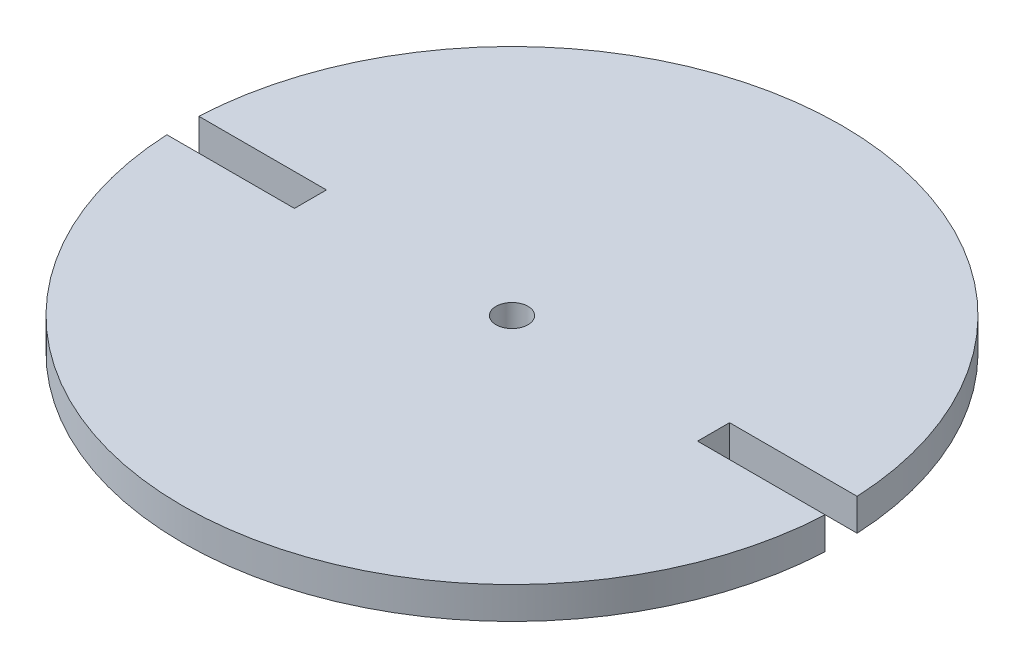
ISO-10303-21;
HEADER;
FILE_DESCRIPTION(('STEP AP214'),'2;1');
FILE_NAME('part.step','',(''),(''),'','','');
FILE_SCHEMA(('AUTOMOTIVE_DESIGN { 1 0 10303 214 1 1 1 1 }'));
ENDSEC;
DATA;
#1=APPLICATION_CONTEXT('core data for automotive mechanical design processes');
#2=APPLICATION_PROTOCOL_DEFINITION('international standard','automotive_design',2000,#1);
#3=PRODUCT_CONTEXT('',#1,'mechanical');
#4=PRODUCT('Part','Part','',(#3));
#5=PRODUCT_RELATED_PRODUCT_CATEGORY('part','',(#4));
#6=PRODUCT_DEFINITION_FORMATION('','',#4);
#7=PRODUCT_DEFINITION_CONTEXT('part definition',#1,'design');
#8=PRODUCT_DEFINITION('design','',#6,#7);
#9=PRODUCT_DEFINITION_SHAPE('','',#8);
#10=(LENGTH_UNIT() NAMED_UNIT(*) SI_UNIT(.MILLI.,.METRE.));
#11=(NAMED_UNIT(*) PLANE_ANGLE_UNIT() SI_UNIT($,.RADIAN.));
#12=(NAMED_UNIT(*) SI_UNIT($,.STERADIAN.) SOLID_ANGLE_UNIT());
#13=UNCERTAINTY_MEASURE_WITH_UNIT(LENGTH_MEASURE(1.E-05),#10,'distance_accuracy_value','');
#14=(GEOMETRIC_REPRESENTATION_CONTEXT(3) GLOBAL_UNCERTAINTY_ASSIGNED_CONTEXT((#13)) GLOBAL_UNIT_ASSIGNED_CONTEXT((#10,
#11,#12)) REPRESENTATION_CONTEXT('',''));
#15=CARTESIAN_POINT('',(0.,0.,0.));
#16=DIRECTION('',(0.,0.,1.));
#17=DIRECTION('',(1.,0.,0.));
#18=AXIS2_PLACEMENT_3D('',#15,#16,#17);
#19=CARTESIAN_POINT('',(0.,6.35,0.));
#20=DIRECTION('',(0.,-1.,0.));
#21=DIRECTION('',(0.,0.,-1.));
#22=AXIS2_PLACEMENT_3D('',#19,#20,#21);
#23=CYLINDRICAL_SURFACE('',#22,65.405);
#24=CARTESIAN_POINT('',(0.,6.35,0.));
#25=DIRECTION('',(0.,1.,0.));
#26=DIRECTION('',(0.,0.,1.));
#27=AXIS2_PLACEMENT_3D('',#24,#25,#26);
#28=CIRCLE('',#27,65.405);
#29=CARTESIAN_POINT('',(-65.3278914400274,6.35,3.175));
#30=VERTEX_POINT('',#29);
#31=CARTESIAN_POINT('',(65.3278914400274,6.35,3.175));
#32=VERTEX_POINT('',#31);
#33=EDGE_CURVE('E164',#30,#32,#28,.T.);
#34=ORIENTED_EDGE('',*,*,#33,.F.);
#35=DIRECTION('',(0.,-1.,0.));
#36=VECTOR('',#35,1.);
#37=CARTESIAN_POINT('',(-65.3278914400274,6.35,3.175));
#38=LINE('',#37,#36);
#39=CARTESIAN_POINT('',(-65.3278914400274,0.,3.175));
#40=VERTEX_POINT('',#39);
#41=EDGE_CURVE('E160',#30,#40,#38,.T.);
#42=ORIENTED_EDGE('',*,*,#41,.T.);
#43=CARTESIAN_POINT('',(0.,0.,0.));
#44=DIRECTION('',(0.,1.,0.));
#45=DIRECTION('',(0.,0.,1.));
#46=AXIS2_PLACEMENT_3D('',#43,#44,#45);
#47=CIRCLE('',#46,65.405);
#48=CARTESIAN_POINT('',(65.3278914400274,0.,3.175));
#49=VERTEX_POINT('',#48);
#50=EDGE_CURVE('E163',#40,#49,#47,.T.);
#51=ORIENTED_EDGE('',*,*,#50,.T.);
#52=DIRECTION('',(0.,-1.,0.));
#53=VECTOR('',#52,1.);
#54=CARTESIAN_POINT('',(65.3278914400274,6.35,3.175));
#55=LINE('',#54,#53);
#56=EDGE_CURVE('E64',#49,#32,#55,.F.);
#57=ORIENTED_EDGE('',*,*,#56,.T.);
#58=EDGE_LOOP('',(#34,#42,#51,#57));
#59=FACE_BOUND('',#58,.T.);
#60=ADVANCED_FACE('F41',(#59),#23,.T.);
#61=CARTESIAN_POINT('',(65.3278914400274,0.,-3.175));
#62=VERTEX_POINT('',#61);
#63=CARTESIAN_POINT('',(-65.3278914400274,0.,-3.175));
#64=VERTEX_POINT('',#63);
#65=EDGE_CURVE('E168',#62,#64,#47,.T.);
#66=ORIENTED_EDGE('',*,*,#65,.T.);
#67=DIRECTION('',(0.,-1.,0.));
#68=VECTOR('',#67,1.);
#69=CARTESIAN_POINT('',(-65.3278914400274,6.35,-3.175));
#70=LINE('',#69,#68);
#71=CARTESIAN_POINT('',(-65.3278914400274,6.35,-3.175));
#72=VERTEX_POINT('',#71);
#73=EDGE_CURVE('E56',#64,#72,#70,.F.);
#74=ORIENTED_EDGE('',*,*,#73,.T.);
#75=CARTESIAN_POINT('',(65.3278914400274,6.35,-3.175));
#76=VERTEX_POINT('',#75);
#77=EDGE_CURVE('E167',#76,#72,#28,.T.);
#78=ORIENTED_EDGE('',*,*,#77,.F.);
#79=DIRECTION('',(0.,-1.,0.));
#80=VECTOR('',#79,1.);
#81=CARTESIAN_POINT('',(65.3278914400274,6.35,-3.175));
#82=LINE('',#81,#80);
#83=EDGE_CURVE('E156',#76,#62,#82,.T.);
#84=ORIENTED_EDGE('',*,*,#83,.T.);
#85=EDGE_LOOP('',(#66,#74,#78,#84));
#86=FACE_BOUND('',#85,.T.);
#87=ADVANCED_FACE('F43',(#86),#23,.T.);
#88=CARTESIAN_POINT('',(0.,6.35,0.));
#89=DIRECTION('',(0.,1.,0.));
#90=DIRECTION('',(0.,0.,1.));
#91=AXIS2_PLACEMENT_3D('',#88,#89,#90);
#92=PLANE('',#91);
#93=CARTESIAN_POINT('',(0.,6.35,0.));
#94=DIRECTION('',(0.,1.,0.));
#95=DIRECTION('',(0.,0.,1.));
#96=AXIS2_PLACEMENT_3D('',#93,#94,#95);
#97=CIRCLE('',#96,3.175);
#98=CARTESIAN_POINT('',(0.,6.35,3.175));
#99=VERTEX_POINT('',#98);
#100=EDGE_CURVE('E131',#99,#99,#97,.T.);
#101=ORIENTED_EDGE('',*,*,#100,.F.);
#102=EDGE_LOOP('',(#101));
#103=FACE_BOUND('',#102,.T.);
#104=DIRECTION('',(1.,0.,0.));
#105=VECTOR('',#104,1.);
#106=CARTESIAN_POINT('',(-90.805,6.35,3.175));
#107=LINE('',#106,#105);
#108=CARTESIAN_POINT('',(-40.005,6.35,3.175));
#109=VERTEX_POINT('',#108);
#110=EDGE_CURVE('E126',#30,#109,#107,.T.);
#111=ORIENTED_EDGE('',*,*,#110,.F.);
#112=ORIENTED_EDGE('',*,*,#33,.T.);
#113=DIRECTION('',(1.,0.,0.));
#114=VECTOR('',#113,1.);
#115=CARTESIAN_POINT('',(90.805,6.35,3.175));
#116=LINE('',#115,#114);
#117=CARTESIAN_POINT('',(40.005,6.35,3.175));
#118=VERTEX_POINT('',#117);
#119=EDGE_CURVE('E147',#118,#32,#116,.T.);
#120=ORIENTED_EDGE('',*,*,#119,.F.);
#121=DIRECTION('',(0.,0.,1.));
#122=VECTOR('',#121,1.);
#123=CARTESIAN_POINT('',(40.005,6.35,-3.175));
#124=LINE('',#123,#122);
#125=CARTESIAN_POINT('',(40.005,6.35,-3.175));
#126=VERTEX_POINT('',#125);
#127=EDGE_CURVE('E135',#126,#118,#124,.T.);
#128=ORIENTED_EDGE('',*,*,#127,.F.);
#129=DIRECTION('',(-1.,0.,0.));
#130=VECTOR('',#129,1.);
#131=CARTESIAN_POINT('',(90.805,6.35,-3.175));
#132=LINE('',#131,#130);
#133=EDGE_CURVE('E145',#76,#126,#132,.T.);
#134=ORIENTED_EDGE('',*,*,#133,.F.);
#135=ORIENTED_EDGE('',*,*,#77,.T.);
#136=DIRECTION('',(-1.,0.,0.));
#137=VECTOR('',#136,1.);
#138=CARTESIAN_POINT('',(-90.805,6.35,-3.175));
#139=LINE('',#138,#137);
#140=CARTESIAN_POINT('',(-40.005,6.35,-3.175));
#141=VERTEX_POINT('',#140);
#142=EDGE_CURVE('E128',#141,#72,#139,.T.);
#143=ORIENTED_EDGE('',*,*,#142,.F.);
#144=DIRECTION('',(0.,0.,-1.));
#145=VECTOR('',#144,1.);
#146=CARTESIAN_POINT('',(-40.005,6.35,3.175));
#147=LINE('',#146,#145);
#148=EDGE_CURVE('E114',#109,#141,#147,.T.);
#149=ORIENTED_EDGE('',*,*,#148,.F.);
#150=EDGE_LOOP('',(#111,#112,#120,#128,#134,#135,#143,#149));
#151=FACE_BOUND('',#150,.T.);
#152=ADVANCED_FACE('F176',(#103,#151),#92,.T.);
#153=CARTESIAN_POINT('',(0.,0.,0.));
#154=DIRECTION('',(0.,1.,0.));
#155=DIRECTION('',(0.,0.,1.));
#156=AXIS2_PLACEMENT_3D('',#153,#154,#155);
#157=PLANE('',#156);
#158=CARTESIAN_POINT('',(0.,0.,0.));
#159=DIRECTION('',(0.,1.,0.));
#160=DIRECTION('',(0.,0.,1.));
#161=AXIS2_PLACEMENT_3D('',#158,#159,#160);
#162=CIRCLE('',#161,3.175);
#163=CARTESIAN_POINT('',(0.,0.,3.175));
#164=VERTEX_POINT('',#163);
#165=EDGE_CURVE('E144',#164,#164,#162,.T.);
#166=ORIENTED_EDGE('',*,*,#165,.T.);
#167=EDGE_LOOP('',(#166));
#168=FACE_BOUND('',#167,.T.);
#169=ORIENTED_EDGE('',*,*,#50,.F.);
#170=DIRECTION('',(1.,0.,0.));
#171=VECTOR('',#170,1.);
#172=CARTESIAN_POINT('',(0.,0.,3.175));
#173=LINE('',#172,#171);
#174=CARTESIAN_POINT('',(-40.005,0.,3.175));
#175=VERTEX_POINT('',#174);
#176=EDGE_CURVE('E11',#40,#175,#173,.T.);
#177=ORIENTED_EDGE('',*,*,#176,.T.);
#178=DIRECTION('',(0.,0.,-1.));
#179=VECTOR('',#178,1.);
#180=CARTESIAN_POINT('',(-40.005,0.,3.175));
#181=LINE('',#180,#179);
#182=CARTESIAN_POINT('',(-40.005,0.,-3.175));
#183=VERTEX_POINT('',#182);
#184=EDGE_CURVE('E112',#175,#183,#181,.T.);
#185=ORIENTED_EDGE('',*,*,#184,.T.);
#186=DIRECTION('',(-1.,0.,0.));
#187=VECTOR('',#186,1.);
#188=CARTESIAN_POINT('',(-90.805,0.,-3.175));
#189=LINE('',#188,#187);
#190=EDGE_CURVE('E117',#183,#64,#189,.T.);
#191=ORIENTED_EDGE('',*,*,#190,.T.);
#192=ORIENTED_EDGE('',*,*,#65,.F.);
#193=DIRECTION('',(-1.,0.,0.));
#194=VECTOR('',#193,1.);
#195=CARTESIAN_POINT('',(0.,0.,-3.17499999999999));
#196=LINE('',#195,#194);
#197=CARTESIAN_POINT('',(40.005,0.,-3.175));
#198=VERTEX_POINT('',#197);
#199=EDGE_CURVE('E49',#62,#198,#196,.T.);
#200=ORIENTED_EDGE('',*,*,#199,.T.);
#201=DIRECTION('',(0.,0.,1.));
#202=VECTOR('',#201,1.);
#203=CARTESIAN_POINT('',(40.005,0.,-3.175));
#204=LINE('',#203,#202);
#205=CARTESIAN_POINT('',(40.005,0.,3.175));
#206=VERTEX_POINT('',#205);
#207=EDGE_CURVE('E148',#198,#206,#204,.T.);
#208=ORIENTED_EDGE('',*,*,#207,.T.);
#209=DIRECTION('',(1.,0.,0.));
#210=VECTOR('',#209,1.);
#211=CARTESIAN_POINT('',(90.805,0.,3.175));
#212=LINE('',#211,#210);
#213=EDGE_CURVE('E140',#206,#49,#212,.T.);
#214=ORIENTED_EDGE('',*,*,#213,.T.);
#215=EDGE_LOOP('',(#169,#177,#185,#191,#192,#200,#208,#214));
#216=FACE_BOUND('',#215,.T.);
#217=ADVANCED_FACE('F125',(#168,#216),#157,.F.);
#218=CARTESIAN_POINT('',(90.805,0.,-3.175));
#219=DIRECTION('',(0.,0.,-1.));
#220=DIRECTION('',(-1.,0.,0.));
#221=AXIS2_PLACEMENT_3D('',#218,#219,#220);
#222=PLANE('',#221);
#223=ORIENTED_EDGE('',*,*,#133,.T.);
#224=DIRECTION('',(0.,1.,0.));
#225=VECTOR('',#224,1.);
#226=CARTESIAN_POINT('',(40.005,0.,-3.175));
#227=LINE('',#226,#225);
#228=EDGE_CURVE('E141',#198,#126,#227,.T.);
#229=ORIENTED_EDGE('',*,*,#228,.F.);
#230=ORIENTED_EDGE('',*,*,#199,.F.);
#231=ORIENTED_EDGE('',*,*,#83,.F.);
#232=EDGE_LOOP('',(#223,#229,#230,#231));
#233=FACE_BOUND('',#232,.T.);
#234=ADVANCED_FACE('F180',(#233),#222,.F.);
#235=CARTESIAN_POINT('',(90.805,0.,3.175));
#236=DIRECTION('',(0.,0.,1.));
#237=DIRECTION('',(1.,0.,0.));
#238=AXIS2_PLACEMENT_3D('',#235,#236,#237);
#239=PLANE('',#238);
#240=ORIENTED_EDGE('',*,*,#213,.F.);
#241=DIRECTION('',(0.,1.,0.));
#242=VECTOR('',#241,1.);
#243=CARTESIAN_POINT('',(40.005,0.,3.175));
#244=LINE('',#243,#242);
#245=EDGE_CURVE('E138',#206,#118,#244,.T.);
#246=ORIENTED_EDGE('',*,*,#245,.T.);
#247=ORIENTED_EDGE('',*,*,#119,.T.);
#248=ORIENTED_EDGE('',*,*,#56,.F.);
#249=EDGE_LOOP('',(#240,#246,#247,#248));
#250=FACE_BOUND('',#249,.T.);
#251=ADVANCED_FACE('F189',(#250),#239,.F.);
#252=CARTESIAN_POINT('',(40.005,0.,-3.175));
#253=DIRECTION('',(-1.,0.,0.));
#254=DIRECTION('',(0.,0.,1.));
#255=AXIS2_PLACEMENT_3D('',#252,#253,#254);
#256=PLANE('',#255);
#257=ORIENTED_EDGE('',*,*,#127,.T.);
#258=ORIENTED_EDGE('',*,*,#245,.F.);
#259=ORIENTED_EDGE('',*,*,#207,.F.);
#260=ORIENTED_EDGE('',*,*,#228,.T.);
#261=EDGE_LOOP('',(#257,#258,#259,#260));
#262=FACE_BOUND('',#261,.T.);
#263=ADVANCED_FACE('F183',(#262),#256,.F.);
#264=CARTESIAN_POINT('',(-90.805,0.,3.175));
#265=DIRECTION('',(0.,0.,1.));
#266=DIRECTION('',(1.,0.,0.));
#267=AXIS2_PLACEMENT_3D('',#264,#265,#266);
#268=PLANE('',#267);
#269=ORIENTED_EDGE('',*,*,#110,.T.);
#270=DIRECTION('',(0.,1.,0.));
#271=VECTOR('',#270,1.);
#272=CARTESIAN_POINT('',(-40.005,0.,3.175));
#273=LINE('',#272,#271);
#274=EDGE_CURVE('E116',#175,#109,#273,.T.);
#275=ORIENTED_EDGE('',*,*,#274,.F.);
#276=ORIENTED_EDGE('',*,*,#176,.F.);
#277=ORIENTED_EDGE('',*,*,#41,.F.);
#278=EDGE_LOOP('',(#269,#275,#276,#277));
#279=FACE_BOUND('',#278,.T.);
#280=ADVANCED_FACE('F187',(#279),#268,.F.);
#281=CARTESIAN_POINT('',(-90.805,0.,-3.175));
#282=DIRECTION('',(0.,0.,-1.));
#283=DIRECTION('',(-1.,0.,0.));
#284=AXIS2_PLACEMENT_3D('',#281,#282,#283);
#285=PLANE('',#284);
#286=ORIENTED_EDGE('',*,*,#190,.F.);
#287=DIRECTION('',(0.,1.,0.));
#288=VECTOR('',#287,1.);
#289=CARTESIAN_POINT('',(-40.005,0.,-3.175));
#290=LINE('',#289,#288);
#291=EDGE_CURVE('E108',#183,#141,#290,.T.);
#292=ORIENTED_EDGE('',*,*,#291,.T.);
#293=ORIENTED_EDGE('',*,*,#142,.T.);
#294=ORIENTED_EDGE('',*,*,#73,.F.);
#295=EDGE_LOOP('',(#286,#292,#293,#294));
#296=FACE_BOUND('',#295,.T.);
#297=ADVANCED_FACE('F119',(#296),#285,.F.);
#298=CARTESIAN_POINT('',(-40.005,0.,3.175));
#299=DIRECTION('',(1.,0.,0.));
#300=DIRECTION('',(0.,0.,-1.));
#301=AXIS2_PLACEMENT_3D('',#298,#299,#300);
#302=PLANE('',#301);
#303=ORIENTED_EDGE('',*,*,#148,.T.);
#304=ORIENTED_EDGE('',*,*,#291,.F.);
#305=ORIENTED_EDGE('',*,*,#184,.F.);
#306=ORIENTED_EDGE('',*,*,#274,.T.);
#307=EDGE_LOOP('',(#303,#304,#305,#306));
#308=FACE_BOUND('',#307,.T.);
#309=ADVANCED_FACE('F109',(#308),#302,.F.);
#310=CARTESIAN_POINT('',(0.,0.,0.));
#311=DIRECTION('',(0.,1.,0.));
#312=DIRECTION('',(0.,0.,1.));
#313=AXIS2_PLACEMENT_3D('',#310,#311,#312);
#314=CYLINDRICAL_SURFACE('',#313,3.175);
#315=ORIENTED_EDGE('',*,*,#165,.F.);
#316=EDGE_LOOP('',(#315));
#317=FACE_BOUND('',#316,.T.);
#318=ORIENTED_EDGE('',*,*,#100,.T.);
#319=EDGE_LOOP('',(#318));
#320=FACE_BOUND('',#319,.T.);
#321=ADVANCED_FACE('F218',(#317,#320),#314,.F.);
#322=CLOSED_SHELL('',(#60,#87,#152,#217,#234,#251,#263,#280,#297,#309,#321));
#323=MANIFOLD_SOLID_BREP('B2',#322);
#324=ADVANCED_BREP_SHAPE_REPRESENTATION('',(#18,#323),#14);
#325=SHAPE_DEFINITION_REPRESENTATION(#9,#324);
ENDSEC;
END-ISO-10303-21;
